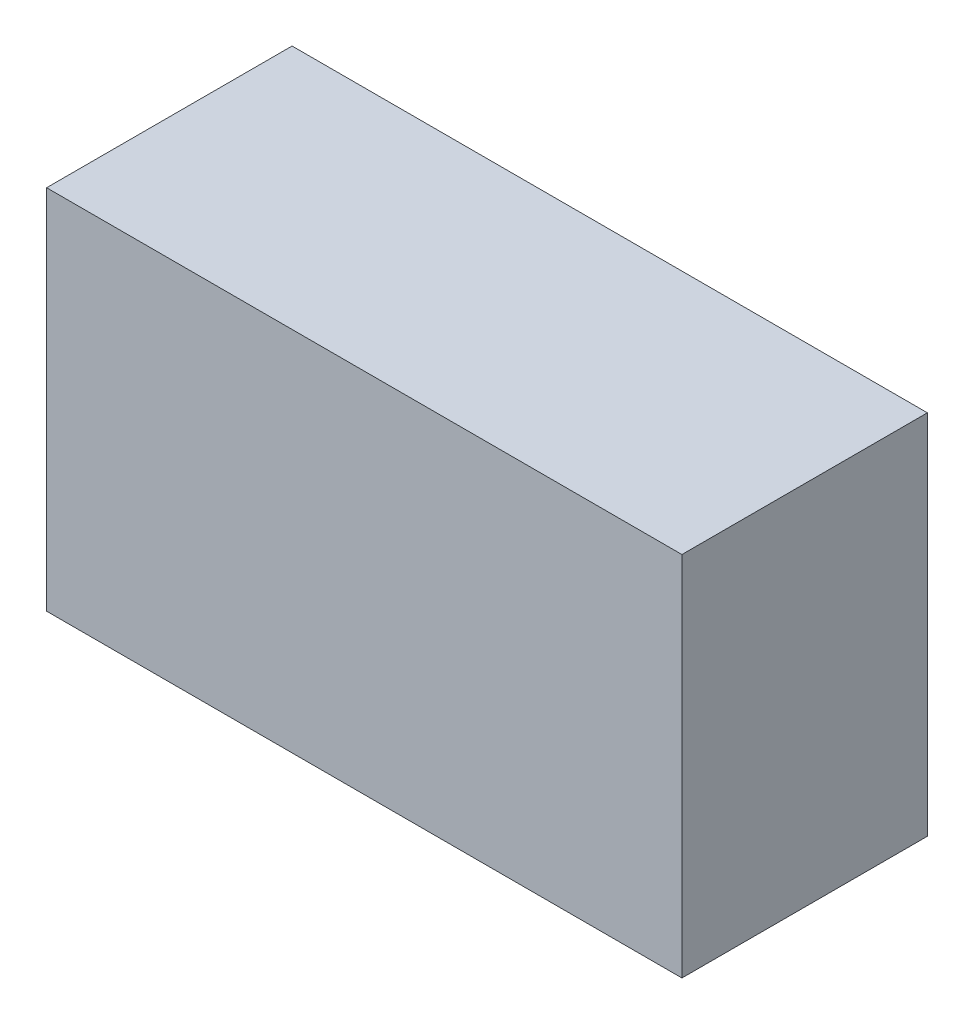
ISO-10303-21;
HEADER;
FILE_DESCRIPTION(('STEP AP214'),'2;1');
FILE_NAME('part.step','',(''),(''),'','','');
FILE_SCHEMA(('AUTOMOTIVE_DESIGN { 1 0 10303 214 1 1 1 1 }'));
ENDSEC;
DATA;
#1=APPLICATION_CONTEXT('core data for automotive mechanical design processes');
#2=APPLICATION_PROTOCOL_DEFINITION('international standard','automotive_design',2000,#1);
#3=PRODUCT_CONTEXT('',#1,'mechanical');
#4=PRODUCT('Part','Part','',(#3));
#5=PRODUCT_RELATED_PRODUCT_CATEGORY('part','',(#4));
#6=PRODUCT_DEFINITION_FORMATION('','',#4);
#7=PRODUCT_DEFINITION_CONTEXT('part definition',#1,'design');
#8=PRODUCT_DEFINITION('design','',#6,#7);
#9=PRODUCT_DEFINITION_SHAPE('','',#8);
#10=(LENGTH_UNIT() NAMED_UNIT(*) SI_UNIT(.MILLI.,.METRE.));
#11=(NAMED_UNIT(*) PLANE_ANGLE_UNIT() SI_UNIT($,.RADIAN.));
#12=(NAMED_UNIT(*) SI_UNIT($,.STERADIAN.) SOLID_ANGLE_UNIT());
#13=UNCERTAINTY_MEASURE_WITH_UNIT(LENGTH_MEASURE(1.E-05),#10,'distance_accuracy_value','');
#14=(GEOMETRIC_REPRESENTATION_CONTEXT(3) GLOBAL_UNCERTAINTY_ASSIGNED_CONTEXT((#13)) GLOBAL_UNIT_ASSIGNED_CONTEXT((#10,
#11,#12)) REPRESENTATION_CONTEXT('',''));
#15=CARTESIAN_POINT('',(0.,0.,0.));
#16=DIRECTION('',(0.,0.,1.));
#17=DIRECTION('',(1.,0.,0.));
#18=AXIS2_PLACEMENT_3D('',#15,#16,#17);
#19=CARTESIAN_POINT('',(-1.10000034,-0.635,0.85));
#20=DIRECTION('',(0.,0.,1.));
#21=DIRECTION('',(1.,0.,0.));
#22=AXIS2_PLACEMENT_3D('',#19,#20,#21);
#23=PLANE('',#22);
#24=DIRECTION('',(1.,0.,0.));
#25=VECTOR('',#24,1.);
#26=CARTESIAN_POINT('',(-1.10000034,0.635,0.85));
#27=LINE('',#26,#25);
#28=CARTESIAN_POINT('',(-1.10000034,0.635,0.85));
#29=VERTEX_POINT('',#28);
#30=CARTESIAN_POINT('',(1.10000034,0.635,0.85));
#31=VERTEX_POINT('',#30);
#32=EDGE_CURVE('E53',#29,#31,#27,.T.);
#33=ORIENTED_EDGE('',*,*,#32,.F.);
#34=DIRECTION('',(0.,1.,0.));
#35=VECTOR('',#34,1.);
#36=CARTESIAN_POINT('',(-1.10000034,-0.635,0.85));
#37=LINE('',#36,#35);
#38=CARTESIAN_POINT('',(-1.10000034,-0.635,0.85));
#39=VERTEX_POINT('',#38);
#40=EDGE_CURVE('E20',#29,#39,#37,.F.);
#41=ORIENTED_EDGE('',*,*,#40,.T.);
#42=DIRECTION('',(1.,0.,0.));
#43=VECTOR('',#42,1.);
#44=CARTESIAN_POINT('',(1.10000034,-0.635,0.85));
#45=LINE('',#44,#43);
#46=CARTESIAN_POINT('',(1.10000034,-0.635,0.85));
#47=VERTEX_POINT('',#46);
#48=EDGE_CURVE('E67',#47,#39,#45,.F.);
#49=ORIENTED_EDGE('',*,*,#48,.F.);
#50=DIRECTION('',(0.,1.,0.));
#51=VECTOR('',#50,1.);
#52=CARTESIAN_POINT('',(1.10000034,0.635,0.85));
#53=LINE('',#52,#51);
#54=EDGE_CURVE('E58',#31,#47,#53,.F.);
#55=ORIENTED_EDGE('',*,*,#54,.F.);
#56=EDGE_LOOP('',(#33,#41,#49,#55));
#57=FACE_BOUND('',#56,.T.);
#58=ADVANCED_FACE('F17',(#57),#23,.T.);
#59=CARTESIAN_POINT('',(1.10000034,-0.635,0.));
#60=DIRECTION('',(0.,-1.,0.));
#61=DIRECTION('',(0.,0.,-1.));
#62=AXIS2_PLACEMENT_3D('',#59,#60,#61);
#63=PLANE('',#62);
#64=DIRECTION('',(0.,0.,1.));
#65=VECTOR('',#64,1.);
#66=CARTESIAN_POINT('',(-1.10000034,-0.635,0.));
#67=LINE('',#66,#65);
#68=CARTESIAN_POINT('',(-1.10000034,-0.635,0.));
#69=VERTEX_POINT('',#68);
#70=EDGE_CURVE('E80',#69,#39,#67,.T.);
#71=ORIENTED_EDGE('',*,*,#70,.F.);
#72=DIRECTION('',(1.,0.,0.));
#73=VECTOR('',#72,1.);
#74=CARTESIAN_POINT('',(-1.10000034,-0.635,0.));
#75=LINE('',#74,#73);
#76=CARTESIAN_POINT('',(1.10000034,-0.635,0.));
#77=VERTEX_POINT('',#76);
#78=EDGE_CURVE('E75',#69,#77,#75,.T.);
#79=ORIENTED_EDGE('',*,*,#78,.T.);
#80=DIRECTION('',(0.,0.,-1.));
#81=VECTOR('',#80,1.);
#82=CARTESIAN_POINT('',(1.10000034,-0.635,0.));
#83=LINE('',#82,#81);
#84=EDGE_CURVE('E63',#47,#77,#83,.T.);
#85=ORIENTED_EDGE('',*,*,#84,.F.);
#86=ORIENTED_EDGE('',*,*,#48,.T.);
#87=EDGE_LOOP('',(#71,#79,#85,#86));
#88=FACE_BOUND('',#87,.T.);
#89=ADVANCED_FACE('F74',(#88),#63,.T.);
#90=CARTESIAN_POINT('',(1.10000034,0.635,0.));
#91=DIRECTION('',(1.,0.,0.));
#92=DIRECTION('',(0.,0.,-1.));
#93=AXIS2_PLACEMENT_3D('',#90,#91,#92);
#94=PLANE('',#93);
#95=ORIENTED_EDGE('',*,*,#84,.T.);
#96=DIRECTION('',(0.,1.,0.));
#97=VECTOR('',#96,1.);
#98=CARTESIAN_POINT('',(1.10000034,-0.635,0.));
#99=LINE('',#98,#97);
#100=CARTESIAN_POINT('',(1.10000034,0.635,0.));
#101=VERTEX_POINT('',#100);
#102=EDGE_CURVE('E84',#77,#101,#99,.T.);
#103=ORIENTED_EDGE('',*,*,#102,.T.);
#104=DIRECTION('',(0.,0.,1.));
#105=VECTOR('',#104,1.);
#106=CARTESIAN_POINT('',(1.10000034,0.635,0.));
#107=LINE('',#106,#105);
#108=EDGE_CURVE('E65',#31,#101,#107,.F.);
#109=ORIENTED_EDGE('',*,*,#108,.F.);
#110=ORIENTED_EDGE('',*,*,#54,.T.);
#111=EDGE_LOOP('',(#95,#103,#109,#110));
#112=FACE_BOUND('',#111,.T.);
#113=ADVANCED_FACE('F60',(#112),#94,.T.);
#114=CARTESIAN_POINT('',(-1.10000034,0.635,0.));
#115=DIRECTION('',(0.,1.,0.));
#116=DIRECTION('',(0.,0.,1.));
#117=AXIS2_PLACEMENT_3D('',#114,#115,#116);
#118=PLANE('',#117);
#119=ORIENTED_EDGE('',*,*,#108,.T.);
#120=DIRECTION('',(1.,0.,0.));
#121=VECTOR('',#120,1.);
#122=CARTESIAN_POINT('',(-1.10000034,0.635,0.));
#123=LINE('',#122,#121);
#124=CARTESIAN_POINT('',(-1.10000034,0.635,0.));
#125=VERTEX_POINT('',#124);
#126=EDGE_CURVE('E26',#101,#125,#123,.F.);
#127=ORIENTED_EDGE('',*,*,#126,.T.);
#128=DIRECTION('',(0.,0.,1.));
#129=VECTOR('',#128,1.);
#130=CARTESIAN_POINT('',(-1.10000034,0.635,0.));
#131=LINE('',#130,#129);
#132=EDGE_CURVE('E34',#29,#125,#131,.F.);
#133=ORIENTED_EDGE('',*,*,#132,.F.);
#134=ORIENTED_EDGE('',*,*,#32,.T.);
#135=EDGE_LOOP('',(#119,#127,#133,#134));
#136=FACE_BOUND('',#135,.T.);
#137=ADVANCED_FACE('F88',(#136),#118,.T.);
#138=CARTESIAN_POINT('',(-1.10000034,-0.635,0.));
#139=DIRECTION('',(-1.,0.,0.));
#140=DIRECTION('',(0.,0.,1.));
#141=AXIS2_PLACEMENT_3D('',#138,#139,#140);
#142=PLANE('',#141);
#143=ORIENTED_EDGE('',*,*,#132,.T.);
#144=DIRECTION('',(0.,1.,0.));
#145=VECTOR('',#144,1.);
#146=CARTESIAN_POINT('',(-1.10000034,-0.635,0.));
#147=LINE('',#146,#145);
#148=EDGE_CURVE('E11',#125,#69,#147,.F.);
#149=ORIENTED_EDGE('',*,*,#148,.T.);
#150=ORIENTED_EDGE('',*,*,#70,.T.);
#151=ORIENTED_EDGE('',*,*,#40,.F.);
#152=EDGE_LOOP('',(#143,#149,#150,#151));
#153=FACE_BOUND('',#152,.T.);
#154=ADVANCED_FACE('F91',(#153),#142,.T.);
#155=CARTESIAN_POINT('',(-1.10000034,-0.635,0.));
#156=DIRECTION('',(0.,0.,1.));
#157=DIRECTION('',(1.,0.,0.));
#158=AXIS2_PLACEMENT_3D('',#155,#156,#157);
#159=PLANE('',#158);
#160=ORIENTED_EDGE('',*,*,#126,.F.);
#161=ORIENTED_EDGE('',*,*,#102,.F.);
#162=ORIENTED_EDGE('',*,*,#78,.F.);
#163=ORIENTED_EDGE('',*,*,#148,.F.);
#164=EDGE_LOOP('',(#160,#161,#162,#163));
#165=FACE_BOUND('',#164,.T.);
#166=ADVANCED_FACE('F90',(#165),#159,.F.);
#167=CLOSED_SHELL('',(#58,#89,#113,#137,#154,#166));
#168=MANIFOLD_SOLID_BREP('B1',#167);
#169=ADVANCED_BREP_SHAPE_REPRESENTATION('',(#18,#168),#14);
#170=SHAPE_DEFINITION_REPRESENTATION(#9,#169);
ENDSEC;
END-ISO-10303-21;
